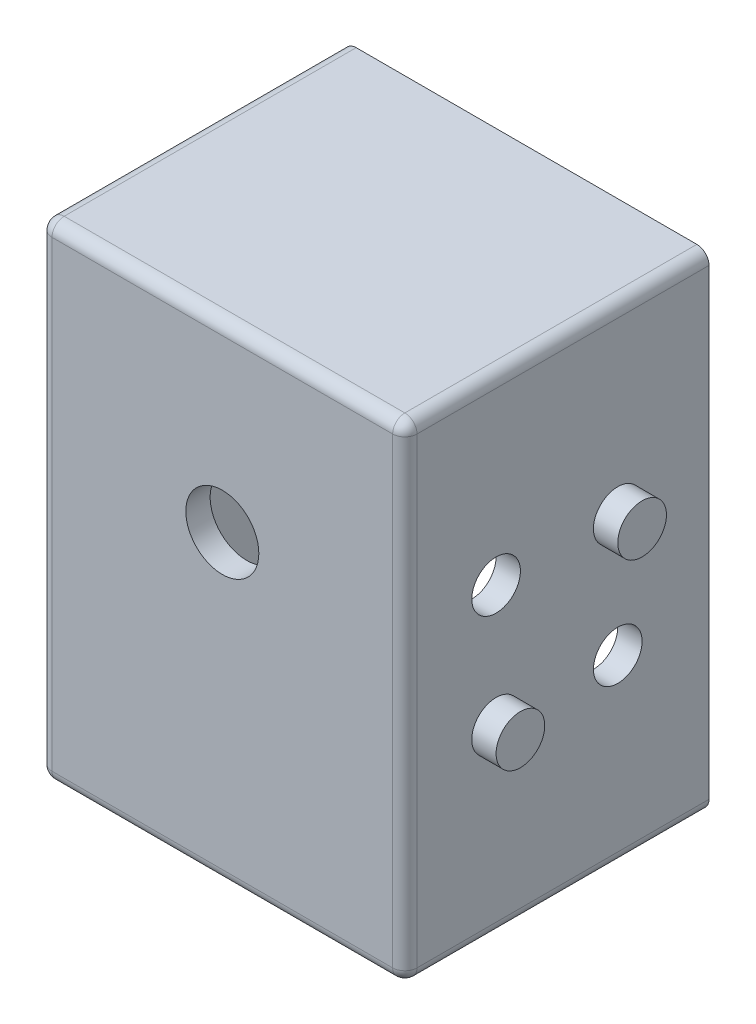
ISO-10303-21;
HEADER;
FILE_DESCRIPTION(('STEP AP214'),'2;1');
FILE_NAME('part.step','',(''),(''),'','','');
FILE_SCHEMA(('AUTOMOTIVE_DESIGN { 1 0 10303 214 1 1 1 1 }'));
ENDSEC;
DATA;
#1=APPLICATION_CONTEXT('core data for automotive mechanical design processes');
#2=APPLICATION_PROTOCOL_DEFINITION('international standard','automotive_design',2000,#1);
#3=PRODUCT_CONTEXT('',#1,'mechanical');
#4=PRODUCT('Part','Part','',(#3));
#5=PRODUCT_RELATED_PRODUCT_CATEGORY('part','',(#4));
#6=PRODUCT_DEFINITION_FORMATION('','',#4);
#7=PRODUCT_DEFINITION_CONTEXT('part definition',#1,'design');
#8=PRODUCT_DEFINITION('design','',#6,#7);
#9=PRODUCT_DEFINITION_SHAPE('','',#8);
#10=(LENGTH_UNIT() NAMED_UNIT(*) SI_UNIT(.MILLI.,.METRE.));
#11=(NAMED_UNIT(*) PLANE_ANGLE_UNIT() SI_UNIT($,.RADIAN.));
#12=(NAMED_UNIT(*) SI_UNIT($,.STERADIAN.) SOLID_ANGLE_UNIT());
#13=UNCERTAINTY_MEASURE_WITH_UNIT(LENGTH_MEASURE(1.E-05),#10,'distance_accuracy_value','');
#14=(GEOMETRIC_REPRESENTATION_CONTEXT(3) GLOBAL_UNCERTAINTY_ASSIGNED_CONTEXT((#13)) GLOBAL_UNIT_ASSIGNED_CONTEXT((#10,
#11,#12)) REPRESENTATION_CONTEXT('',''));
#15=CARTESIAN_POINT('',(0.,0.,0.));
#16=DIRECTION('',(0.,0.,1.));
#17=DIRECTION('',(1.,0.,0.));
#18=AXIS2_PLACEMENT_3D('',#15,#16,#17);
#19=CARTESIAN_POINT('',(0.,0.,0.));
#20=DIRECTION('',(0.,0.,-1.));
#21=DIRECTION('',(-1.,0.,0.));
#22=AXIS2_PLACEMENT_3D('',#19,#20,#21);
#23=PLANE('',#22);
#24=DIRECTION('',(0.,1.,0.));
#25=VECTOR('',#24,1.);
#26=CARTESIAN_POINT('',(30.,0.,0.));
#27=LINE('',#26,#25);
#28=CARTESIAN_POINT('',(30.,1.,0.));
#29=VERTEX_POINT('',#28);
#30=CARTESIAN_POINT('',(30.,39.,0.));
#31=VERTEX_POINT('',#30);
#32=EDGE_CURVE('E185',#29,#31,#27,.T.);
#33=ORIENTED_EDGE('',*,*,#32,.F.);
#34=CARTESIAN_POINT('',(29.,1.,0.));
#35=DIRECTION('',(0.,0.,-1.));
#36=DIRECTION('',(-1.,0.,0.));
#37=AXIS2_PLACEMENT_3D('',#34,#35,#36);
#38=CIRCLE('',#37,1.);
#39=CARTESIAN_POINT('',(29.,0.,0.));
#40=VERTEX_POINT('',#39);
#41=EDGE_CURVE('E245',#29,#40,#38,.T.);
#42=ORIENTED_EDGE('',*,*,#41,.T.);
#43=DIRECTION('',(1.,0.,0.));
#44=VECTOR('',#43,1.);
#45=CARTESIAN_POINT('',(0.,0.,0.));
#46=LINE('',#45,#44);
#47=CARTESIAN_POINT('',(1.,0.,0.));
#48=VERTEX_POINT('',#47);
#49=EDGE_CURVE('E188',#48,#40,#46,.T.);
#50=ORIENTED_EDGE('',*,*,#49,.F.);
#51=CARTESIAN_POINT('',(1.,1.,0.));
#52=DIRECTION('',(0.,0.,-1.));
#53=DIRECTION('',(-1.,0.,0.));
#54=AXIS2_PLACEMENT_3D('',#51,#52,#53);
#55=CIRCLE('',#54,1.);
#56=CARTESIAN_POINT('',(0.,1.,0.));
#57=VERTEX_POINT('',#56);
#58=EDGE_CURVE('E243',#48,#57,#55,.T.);
#59=ORIENTED_EDGE('',*,*,#58,.T.);
#60=DIRECTION('',(0.,1.,0.));
#61=VECTOR('',#60,1.);
#62=CARTESIAN_POINT('',(0.,0.,0.));
#63=LINE('',#62,#61);
#64=CARTESIAN_POINT('',(0.,39.,0.));
#65=VERTEX_POINT('',#64);
#66=EDGE_CURVE('E178',#57,#65,#63,.T.);
#67=ORIENTED_EDGE('',*,*,#66,.T.);
#68=CARTESIAN_POINT('',(0.999999999999993,39.,0.));
#69=DIRECTION('',(0.,0.,-1.));
#70=DIRECTION('',(-1.,0.,0.));
#71=AXIS2_PLACEMENT_3D('',#68,#69,#70);
#72=CIRCLE('',#71,1.);
#73=CARTESIAN_POINT('',(0.999999999999993,40.,0.));
#74=VERTEX_POINT('',#73);
#75=EDGE_CURVE('E241',#65,#74,#72,.T.);
#76=ORIENTED_EDGE('',*,*,#75,.T.);
#77=DIRECTION('',(1.,0.,0.));
#78=VECTOR('',#77,1.);
#79=CARTESIAN_POINT('',(0.,40.,0.));
#80=LINE('',#79,#78);
#81=CARTESIAN_POINT('',(29.,40.,0.));
#82=VERTEX_POINT('',#81);
#83=EDGE_CURVE('E181',#74,#82,#80,.T.);
#84=ORIENTED_EDGE('',*,*,#83,.T.);
#85=CARTESIAN_POINT('',(29.,39.,0.));
#86=DIRECTION('',(0.,0.,-1.));
#87=DIRECTION('',(-1.,0.,0.));
#88=AXIS2_PLACEMENT_3D('',#85,#86,#87);
#89=CIRCLE('',#88,1.);
#90=EDGE_CURVE('E239',#82,#31,#89,.T.);
#91=ORIENTED_EDGE('',*,*,#90,.T.);
#92=EDGE_LOOP('',(#33,#42,#50,#59,#67,#76,#84,#91));
#93=FACE_BOUND('',#92,.T.);
#94=DIRECTION('',(1.,0.,0.));
#95=VECTOR('',#94,1.);
#96=CARTESIAN_POINT('',(0.,2.,0.));
#97=LINE('',#96,#95);
#98=CARTESIAN_POINT('',(2.,2.,0.));
#99=VERTEX_POINT('',#98);
#100=CARTESIAN_POINT('',(28.,2.,0.));
#101=VERTEX_POINT('',#100);
#102=EDGE_CURVE('E172',#99,#101,#97,.T.);
#103=ORIENTED_EDGE('',*,*,#102,.T.);
#104=DIRECTION('',(0.,1.,0.));
#105=VECTOR('',#104,1.);
#106=CARTESIAN_POINT('',(28.,0.,0.));
#107=LINE('',#106,#105);
#108=CARTESIAN_POINT('',(28.,38.,0.));
#109=VERTEX_POINT('',#108);
#110=EDGE_CURVE('E153',#101,#109,#107,.T.);
#111=ORIENTED_EDGE('',*,*,#110,.T.);
#112=DIRECTION('',(1.,0.,0.));
#113=VECTOR('',#112,1.);
#114=CARTESIAN_POINT('',(0.,38.,0.));
#115=LINE('',#114,#113);
#116=CARTESIAN_POINT('',(1.99999999999999,38.,0.));
#117=VERTEX_POINT('',#116);
#118=EDGE_CURVE('E164',#117,#109,#115,.T.);
#119=ORIENTED_EDGE('',*,*,#118,.F.);
#120=DIRECTION('',(0.,1.,0.));
#121=VECTOR('',#120,1.);
#122=CARTESIAN_POINT('',(2.,0.,0.));
#123=LINE('',#122,#121);
#124=EDGE_CURVE('E169',#99,#117,#123,.T.);
#125=ORIENTED_EDGE('',*,*,#124,.F.);
#126=EDGE_LOOP('',(#103,#111,#119,#125));
#127=FACE_BOUND('',#126,.T.);
#128=ADVANCED_FACE('F35',(#93,#127),#23,.T.);
#129=CARTESIAN_POINT('',(0.,0.,25.));
#130=DIRECTION('',(-1.,0.,0.));
#131=DIRECTION('',(0.,-1.,0.));
#132=AXIS2_PLACEMENT_3D('',#129,#130,#131);
#133=PLANE('',#132);
#134=CARTESIAN_POINT('',(0.,15.,7.5));
#135=DIRECTION('',(-1.,0.,0.));
#136=DIRECTION('',(0.,-1.,0.));
#137=AXIS2_PLACEMENT_3D('',#134,#135,#136);
#138=CIRCLE('',#137,2.);
#139=CARTESIAN_POINT('',(0.,13.,7.5));
#140=VERTEX_POINT('',#139);
#141=EDGE_CURVE('E482',#140,#140,#138,.T.);
#142=ORIENTED_EDGE('',*,*,#141,.F.);
#143=EDGE_LOOP('',(#142));
#144=FACE_BOUND('',#143,.T.);
#145=CARTESIAN_POINT('',(0.,25.,16.5));
#146=DIRECTION('',(-1.,0.,0.));
#147=DIRECTION('',(0.,-1.,0.));
#148=AXIS2_PLACEMENT_3D('',#145,#146,#147);
#149=CIRCLE('',#148,2.);
#150=CARTESIAN_POINT('',(0.,23.,16.5));
#151=VERTEX_POINT('',#150);
#152=EDGE_CURVE('E481',#151,#151,#149,.T.);
#153=ORIENTED_EDGE('',*,*,#152,.F.);
#154=EDGE_LOOP('',(#153));
#155=FACE_BOUND('',#154,.T.);
#156=CARTESIAN_POINT('',(0.,25.,7.5));
#157=DIRECTION('',(-1.,0.,0.));
#158=DIRECTION('',(0.,-1.,0.));
#159=AXIS2_PLACEMENT_3D('',#156,#157,#158);
#160=CIRCLE('',#159,2.);
#161=CARTESIAN_POINT('',(0.,23.,7.5));
#162=VERTEX_POINT('',#161);
#163=EDGE_CURVE('E493',#162,#162,#160,.T.);
#164=ORIENTED_EDGE('',*,*,#163,.F.);
#165=EDGE_LOOP('',(#164));
#166=FACE_BOUND('',#165,.T.);
#167=CARTESIAN_POINT('',(0.,15.,16.5));
#168=DIRECTION('',(-1.,0.,0.));
#169=DIRECTION('',(0.,-1.,0.));
#170=AXIS2_PLACEMENT_3D('',#167,#168,#169);
#171=CIRCLE('',#170,2.);
#172=CARTESIAN_POINT('',(0.,13.,16.5));
#173=VERTEX_POINT('',#172);
#174=EDGE_CURVE('E496',#173,#173,#171,.T.);
#175=ORIENTED_EDGE('',*,*,#174,.F.);
#176=EDGE_LOOP('',(#175));
#177=FACE_BOUND('',#176,.T.);
#178=ORIENTED_EDGE('',*,*,#66,.F.);
#179=DIRECTION('',(0.,0.,-1.));
#180=VECTOR('',#179,1.);
#181=CARTESIAN_POINT('',(0.,1.,24.));
#182=LINE('',#181,#180);
#183=CARTESIAN_POINT('',(0.,1.,24.));
#184=VERTEX_POINT('',#183);
#185=EDGE_CURVE('E253',#57,#184,#182,.F.);
#186=ORIENTED_EDGE('',*,*,#185,.T.);
#187=DIRECTION('',(0.,1.,0.));
#188=VECTOR('',#187,1.);
#189=CARTESIAN_POINT('',(0.,40.,24.));
#190=LINE('',#189,#188);
#191=CARTESIAN_POINT('',(0.,39.,24.));
#192=VERTEX_POINT('',#191);
#193=EDGE_CURVE('E209',#184,#192,#190,.T.);
#194=ORIENTED_EDGE('',*,*,#193,.T.);
#195=DIRECTION('',(0.,0.,-1.));
#196=VECTOR('',#195,1.);
#197=CARTESIAN_POINT('',(0.,39.,25.));
#198=LINE('',#197,#196);
#199=EDGE_CURVE('E251',#192,#65,#198,.T.);
#200=ORIENTED_EDGE('',*,*,#199,.T.);
#201=EDGE_LOOP('',(#178,#186,#194,#200));
#202=FACE_BOUND('',#201,.T.);
#203=ADVANCED_FACE('F351',(#144,#155,#166,#177,#202),#133,.T.);
#204=CARTESIAN_POINT('',(0.,0.,25.));
#205=DIRECTION('',(0.,1.,0.));
#206=DIRECTION('',(0.,0.,1.));
#207=AXIS2_PLACEMENT_3D('',#204,#205,#206);
#208=PLANE('',#207);
#209=CARTESIAN_POINT('',(10.,0.,17.5));
#210=DIRECTION('',(0.,1.,0.));
#211=DIRECTION('',(0.,0.,1.));
#212=AXIS2_PLACEMENT_3D('',#209,#210,#211);
#213=CIRCLE('',#212,2.);
#214=CARTESIAN_POINT('',(10.,0.,19.5));
#215=VERTEX_POINT('',#214);
#216=EDGE_CURVE('E295',#215,#215,#213,.F.);
#217=ORIENTED_EDGE('',*,*,#216,.F.);
#218=EDGE_LOOP('',(#217));
#219=FACE_BOUND('',#218,.T.);
#220=CARTESIAN_POINT('',(20.,0.,7.5));
#221=DIRECTION('',(0.,1.,0.));
#222=DIRECTION('',(0.,0.,1.));
#223=AXIS2_PLACEMENT_3D('',#220,#221,#222);
#224=CIRCLE('',#223,2.);
#225=CARTESIAN_POINT('',(20.,0.,9.5));
#226=VERTEX_POINT('',#225);
#227=EDGE_CURVE('E281',#226,#226,#224,.F.);
#228=ORIENTED_EDGE('',*,*,#227,.F.);
#229=EDGE_LOOP('',(#228));
#230=FACE_BOUND('',#229,.T.);
#231=CARTESIAN_POINT('',(20.,0.,17.5));
#232=DIRECTION('',(0.,-1.,0.));
#233=DIRECTION('',(0.,0.,-1.));
#234=AXIS2_PLACEMENT_3D('',#231,#232,#233);
#235=CIRCLE('',#234,2.);
#236=CARTESIAN_POINT('',(20.,0.,15.5));
#237=VERTEX_POINT('',#236);
#238=EDGE_CURVE('E535',#237,#237,#235,.T.);
#239=ORIENTED_EDGE('',*,*,#238,.F.);
#240=EDGE_LOOP('',(#239));
#241=FACE_BOUND('',#240,.T.);
#242=CARTESIAN_POINT('',(10.,0.,7.5));
#243=DIRECTION('',(0.,-1.,0.));
#244=DIRECTION('',(0.,0.,-1.));
#245=AXIS2_PLACEMENT_3D('',#242,#243,#244);
#246=CIRCLE('',#245,2.);
#247=CARTESIAN_POINT('',(10.,0.,5.5));
#248=VERTEX_POINT('',#247);
#249=EDGE_CURVE('E538',#248,#248,#246,.T.);
#250=ORIENTED_EDGE('',*,*,#249,.F.);
#251=EDGE_LOOP('',(#250));
#252=FACE_BOUND('',#251,.T.);
#253=ORIENTED_EDGE('',*,*,#49,.T.);
#254=DIRECTION('',(0.,0.,-1.));
#255=VECTOR('',#254,1.);
#256=CARTESIAN_POINT('',(29.,0.,25.));
#257=LINE('',#256,#255);
#258=CARTESIAN_POINT('',(29.,0.,24.));
#259=VERTEX_POINT('',#258);
#260=EDGE_CURVE('E249',#40,#259,#257,.F.);
#261=ORIENTED_EDGE('',*,*,#260,.T.);
#262=DIRECTION('',(1.,0.,0.));
#263=VECTOR('',#262,1.);
#264=CARTESIAN_POINT('',(0.,0.,24.));
#265=LINE('',#264,#263);
#266=CARTESIAN_POINT('',(1.,0.,24.));
#267=VERTEX_POINT('',#266);
#268=EDGE_CURVE('E203',#259,#267,#265,.F.);
#269=ORIENTED_EDGE('',*,*,#268,.T.);
#270=DIRECTION('',(0.,0.,-1.));
#271=VECTOR('',#270,1.);
#272=CARTESIAN_POINT('',(1.,0.,0.));
#273=LINE('',#272,#271);
#274=EDGE_CURVE('E247',#267,#48,#273,.T.);
#275=ORIENTED_EDGE('',*,*,#274,.T.);
#276=EDGE_LOOP('',(#253,#261,#269,#275));
#277=FACE_BOUND('',#276,.T.);
#278=ADVANCED_FACE('F306',(#219,#230,#241,#252,#277),#208,.F.);
#279=CARTESIAN_POINT('',(30.,0.,25.));
#280=DIRECTION('',(-1.,0.,0.));
#281=DIRECTION('',(0.,-1.,0.));
#282=AXIS2_PLACEMENT_3D('',#279,#280,#281);
#283=PLANE('',#282);
#284=CARTESIAN_POINT('',(30.,15.,7.5));
#285=DIRECTION('',(1.,0.,0.));
#286=DIRECTION('',(0.,1.,0.));
#287=AXIS2_PLACEMENT_3D('',#284,#285,#286);
#288=CIRCLE('',#287,2.);
#289=CARTESIAN_POINT('',(30.,17.,7.5));
#290=VERTEX_POINT('',#289);
#291=EDGE_CURVE('E505',#290,#290,#288,.T.);
#292=ORIENTED_EDGE('',*,*,#291,.F.);
#293=EDGE_LOOP('',(#292));
#294=FACE_BOUND('',#293,.T.);
#295=CARTESIAN_POINT('',(30.,25.,17.5));
#296=DIRECTION('',(1.,0.,0.));
#297=DIRECTION('',(0.,1.,0.));
#298=AXIS2_PLACEMENT_3D('',#295,#296,#297);
#299=CIRCLE('',#298,2.);
#300=CARTESIAN_POINT('',(30.,27.,17.5));
#301=VERTEX_POINT('',#300);
#302=EDGE_CURVE('E508',#301,#301,#299,.T.);
#303=ORIENTED_EDGE('',*,*,#302,.F.);
#304=EDGE_LOOP('',(#303));
#305=FACE_BOUND('',#304,.T.);
#306=CARTESIAN_POINT('',(30.,25.,7.5));
#307=DIRECTION('',(-1.,0.,0.));
#308=DIRECTION('',(0.,-1.,0.));
#309=AXIS2_PLACEMENT_3D('',#306,#307,#308);
#310=CIRCLE('',#309,2.);
#311=CARTESIAN_POINT('',(30.,23.,7.5));
#312=VERTEX_POINT('',#311);
#313=EDGE_CURVE('E11',#312,#312,#310,.F.);
#314=ORIENTED_EDGE('',*,*,#313,.F.);
#315=EDGE_LOOP('',(#314));
#316=FACE_BOUND('',#315,.T.);
#317=CARTESIAN_POINT('',(30.,15.,17.5));
#318=DIRECTION('',(-1.,0.,0.));
#319=DIRECTION('',(0.,-1.,0.));
#320=AXIS2_PLACEMENT_3D('',#317,#318,#319);
#321=CIRCLE('',#320,2.);
#322=CARTESIAN_POINT('',(30.,13.,17.5));
#323=VERTEX_POINT('',#322);
#324=EDGE_CURVE('E43',#323,#323,#321,.F.);
#325=ORIENTED_EDGE('',*,*,#324,.F.);
#326=EDGE_LOOP('',(#325));
#327=FACE_BOUND('',#326,.T.);
#328=DIRECTION('',(0.,1.,0.));
#329=VECTOR('',#328,1.);
#330=CARTESIAN_POINT('',(30.,0.,24.));
#331=LINE('',#330,#329);
#332=CARTESIAN_POINT('',(30.,39.,24.));
#333=VERTEX_POINT('',#332);
#334=CARTESIAN_POINT('',(30.,1.,24.));
#335=VERTEX_POINT('',#334);
#336=EDGE_CURVE('E206',#333,#335,#331,.F.);
#337=ORIENTED_EDGE('',*,*,#336,.T.);
#338=DIRECTION('',(0.,0.,-1.));
#339=VECTOR('',#338,1.);
#340=CARTESIAN_POINT('',(30.,1.,25.));
#341=LINE('',#340,#339);
#342=EDGE_CURVE('E237',#335,#29,#341,.T.);
#343=ORIENTED_EDGE('',*,*,#342,.T.);
#344=ORIENTED_EDGE('',*,*,#32,.T.);
#345=DIRECTION('',(0.,0.,-1.));
#346=VECTOR('',#345,1.);
#347=CARTESIAN_POINT('',(30.,39.,24.));
#348=LINE('',#347,#346);
#349=EDGE_CURVE('E235',#31,#333,#348,.F.);
#350=ORIENTED_EDGE('',*,*,#349,.T.);
#351=EDGE_LOOP('',(#337,#343,#344,#350));
#352=FACE_BOUND('',#351,.T.);
#353=ADVANCED_FACE('F302',(#294,#305,#316,#327,#352),#283,.F.);
#354=CARTESIAN_POINT('',(0.,40.,25.));
#355=DIRECTION('',(0.,1.,0.));
#356=DIRECTION('',(0.,0.,1.));
#357=AXIS2_PLACEMENT_3D('',#354,#355,#356);
#358=PLANE('',#357);
#359=ORIENTED_EDGE('',*,*,#83,.F.);
#360=DIRECTION('',(0.,0.,-1.));
#361=VECTOR('',#360,1.);
#362=CARTESIAN_POINT('',(0.999999999999993,40.,25.));
#363=LINE('',#362,#361);
#364=CARTESIAN_POINT('',(0.999999999999994,40.,24.));
#365=VERTEX_POINT('',#364);
#366=EDGE_CURVE('E257',#74,#365,#363,.F.);
#367=ORIENTED_EDGE('',*,*,#366,.T.);
#368=DIRECTION('',(1.,0.,0.));
#369=VECTOR('',#368,1.);
#370=CARTESIAN_POINT('',(30.,40.,24.));
#371=LINE('',#370,#369);
#372=CARTESIAN_POINT('',(29.,40.,24.));
#373=VERTEX_POINT('',#372);
#374=EDGE_CURVE('E212',#365,#373,#371,.T.);
#375=ORIENTED_EDGE('',*,*,#374,.T.);
#376=DIRECTION('',(0.,0.,-1.));
#377=VECTOR('',#376,1.);
#378=CARTESIAN_POINT('',(29.,40.,0.));
#379=LINE('',#378,#377);
#380=EDGE_CURVE('E255',#373,#82,#379,.T.);
#381=ORIENTED_EDGE('',*,*,#380,.T.);
#382=EDGE_LOOP('',(#359,#367,#375,#381));
#383=FACE_BOUND('',#382,.T.);
#384=ADVANCED_FACE('F305',(#383),#358,.T.);
#385=CARTESIAN_POINT('',(0.,0.,25.));
#386=DIRECTION('',(0.,0.,-1.));
#387=DIRECTION('',(-1.,0.,0.));
#388=AXIS2_PLACEMENT_3D('',#385,#386,#387);
#389=PLANE('',#388);
#390=CARTESIAN_POINT('',(15.,25.,25.));
#391=DIRECTION('',(0.,0.,1.));
#392=DIRECTION('',(1.,0.,0.));
#393=AXIS2_PLACEMENT_3D('',#390,#391,#392);
#394=CIRCLE('',#393,3.);
#395=CARTESIAN_POINT('',(18.,25.,25.));
#396=VERTEX_POINT('',#395);
#397=EDGE_CURVE('E522',#396,#396,#394,.T.);
#398=ORIENTED_EDGE('',*,*,#397,.F.);
#399=EDGE_LOOP('',(#398));
#400=FACE_BOUND('',#399,.T.);
#401=DIRECTION('',(0.,1.,0.));
#402=VECTOR('',#401,1.);
#403=CARTESIAN_POINT('',(1.,0.,25.));
#404=LINE('',#403,#402);
#405=CARTESIAN_POINT('',(0.999999999999993,39.,25.));
#406=VERTEX_POINT('',#405);
#407=CARTESIAN_POINT('',(1.,1.,25.));
#408=VERTEX_POINT('',#407);
#409=EDGE_CURVE('E194',#406,#408,#404,.F.);
#410=ORIENTED_EDGE('',*,*,#409,.T.);
#411=DIRECTION('',(1.,0.,0.));
#412=VECTOR('',#411,1.);
#413=CARTESIAN_POINT('',(0.,1.,25.));
#414=LINE('',#413,#412);
#415=CARTESIAN_POINT('',(29.,1.,25.));
#416=VERTEX_POINT('',#415);
#417=EDGE_CURVE('E200',#408,#416,#414,.T.);
#418=ORIENTED_EDGE('',*,*,#417,.T.);
#419=DIRECTION('',(0.,1.,0.));
#420=VECTOR('',#419,1.);
#421=CARTESIAN_POINT('',(29.,0.,25.));
#422=LINE('',#421,#420);
#423=CARTESIAN_POINT('',(29.,39.,25.));
#424=VERTEX_POINT('',#423);
#425=EDGE_CURVE('E197',#416,#424,#422,.T.);
#426=ORIENTED_EDGE('',*,*,#425,.T.);
#427=DIRECTION('',(1.,0.,0.));
#428=VECTOR('',#427,1.);
#429=CARTESIAN_POINT('',(0.,39.,25.));
#430=LINE('',#429,#428);
#431=EDGE_CURVE('E191',#424,#406,#430,.F.);
#432=ORIENTED_EDGE('',*,*,#431,.T.);
#433=EDGE_LOOP('',(#410,#418,#426,#432));
#434=FACE_BOUND('',#433,.T.);
#435=ADVANCED_FACE('F333',(#400,#434),#389,.F.);
#436=CARTESIAN_POINT('',(0.,39.,24.));
#437=DIRECTION('',(-1.,0.,0.));
#438=DIRECTION('',(0.,0.,1.));
#439=AXIS2_PLACEMENT_3D('',#436,#437,#438);
#440=CYLINDRICAL_SURFACE('',#439,1.);
#441=ORIENTED_EDGE('',*,*,#374,.F.);
#442=CARTESIAN_POINT('',(0.999999999999993,39.,24.));
#443=DIRECTION('',(-1.,0.,0.));
#444=DIRECTION('',(0.,0.,1.));
#445=AXIS2_PLACEMENT_3D('',#442,#443,#444);
#446=CIRCLE('',#445,1.);
#447=EDGE_CURVE('E233',#365,#406,#446,.F.);
#448=ORIENTED_EDGE('',*,*,#447,.T.);
#449=ORIENTED_EDGE('',*,*,#431,.F.);
#450=CARTESIAN_POINT('',(29.,39.,24.));
#451=DIRECTION('',(-1.,0.,0.));
#452=DIRECTION('',(0.,0.,1.));
#453=AXIS2_PLACEMENT_3D('',#450,#451,#452);
#454=CIRCLE('',#453,1.);
#455=EDGE_CURVE('E231',#424,#373,#454,.T.);
#456=ORIENTED_EDGE('',*,*,#455,.T.);
#457=EDGE_LOOP('',(#441,#448,#449,#456));
#458=FACE_BOUND('',#457,.T.);
#459=ADVANCED_FACE('F381',(#458),#440,.T.);
#460=CARTESIAN_POINT('',(1.,0.,24.));
#461=DIRECTION('',(0.,-1.,0.));
#462=DIRECTION('',(1.,0.,0.));
#463=AXIS2_PLACEMENT_3D('',#460,#461,#462);
#464=CYLINDRICAL_SURFACE('',#463,1.);
#465=ORIENTED_EDGE('',*,*,#193,.F.);
#466=CARTESIAN_POINT('',(1.,1.,24.));
#467=DIRECTION('',(0.,-1.,0.));
#468=DIRECTION('',(1.,0.,0.));
#469=AXIS2_PLACEMENT_3D('',#466,#467,#468);
#470=CIRCLE('',#469,1.);
#471=EDGE_CURVE('E229',#184,#408,#470,.F.);
#472=ORIENTED_EDGE('',*,*,#471,.T.);
#473=ORIENTED_EDGE('',*,*,#409,.F.);
#474=CARTESIAN_POINT('',(0.999999999999993,39.,24.));
#475=DIRECTION('',(0.,-1.,0.));
#476=DIRECTION('',(1.,0.,0.));
#477=AXIS2_PLACEMENT_3D('',#474,#475,#476);
#478=CIRCLE('',#477,1.);
#479=EDGE_CURVE('E226',#406,#192,#478,.T.);
#480=ORIENTED_EDGE('',*,*,#479,.T.);
#481=EDGE_LOOP('',(#465,#472,#473,#480));
#482=FACE_BOUND('',#481,.T.);
#483=ADVANCED_FACE('F338',(#482),#464,.T.);
#484=CARTESIAN_POINT('',(29.,0.,24.));
#485=DIRECTION('',(0.,1.,0.));
#486=DIRECTION('',(-1.,0.,0.));
#487=AXIS2_PLACEMENT_3D('',#484,#485,#486);
#488=CYLINDRICAL_SURFACE('',#487,1.);
#489=ORIENTED_EDGE('',*,*,#425,.F.);
#490=CARTESIAN_POINT('',(29.,1.,24.));
#491=DIRECTION('',(0.,1.,0.));
#492=DIRECTION('',(-1.,0.,0.));
#493=AXIS2_PLACEMENT_3D('',#490,#491,#492);
#494=CIRCLE('',#493,1.);
#495=EDGE_CURVE('E224',#416,#335,#494,.T.);
#496=ORIENTED_EDGE('',*,*,#495,.T.);
#497=ORIENTED_EDGE('',*,*,#336,.F.);
#498=CARTESIAN_POINT('',(29.,39.,24.));
#499=DIRECTION('',(0.,1.,0.));
#500=DIRECTION('',(-1.,0.,0.));
#501=AXIS2_PLACEMENT_3D('',#498,#499,#500);
#502=CIRCLE('',#501,1.);
#503=EDGE_CURVE('E221',#333,#424,#502,.F.);
#504=ORIENTED_EDGE('',*,*,#503,.T.);
#505=EDGE_LOOP('',(#489,#496,#497,#504));
#506=FACE_BOUND('',#505,.T.);
#507=ADVANCED_FACE('F329',(#506),#488,.T.);
#508=CARTESIAN_POINT('',(0.,1.,24.));
#509=DIRECTION('',(1.,0.,0.));
#510=DIRECTION('',(0.,0.,-1.));
#511=AXIS2_PLACEMENT_3D('',#508,#509,#510);
#512=CYLINDRICAL_SURFACE('',#511,1.);
#513=ORIENTED_EDGE('',*,*,#268,.F.);
#514=CARTESIAN_POINT('',(29.,1.,24.));
#515=DIRECTION('',(1.,0.,0.));
#516=DIRECTION('',(0.,0.,-1.));
#517=AXIS2_PLACEMENT_3D('',#514,#515,#516);
#518=CIRCLE('',#517,1.);
#519=EDGE_CURVE('E218',#259,#416,#518,.F.);
#520=ORIENTED_EDGE('',*,*,#519,.T.);
#521=ORIENTED_EDGE('',*,*,#417,.F.);
#522=CARTESIAN_POINT('',(1.,1.,24.));
#523=DIRECTION('',(1.,0.,0.));
#524=DIRECTION('',(0.,0.,-1.));
#525=AXIS2_PLACEMENT_3D('',#522,#523,#524);
#526=CIRCLE('',#525,1.);
#527=EDGE_CURVE('E215',#408,#267,#526,.T.);
#528=ORIENTED_EDGE('',*,*,#527,.T.);
#529=EDGE_LOOP('',(#513,#520,#521,#528));
#530=FACE_BOUND('',#529,.T.);
#531=ADVANCED_FACE('F327',(#530),#512,.T.);
#532=CARTESIAN_POINT('',(29.,1.,25.));
#533=DIRECTION('',(0.,0.,-1.));
#534=DIRECTION('',(-1.,0.,0.));
#535=AXIS2_PLACEMENT_3D('',#532,#533,#534);
#536=CYLINDRICAL_SURFACE('',#535,1.);
#537=ORIENTED_EDGE('',*,*,#41,.F.);
#538=ORIENTED_EDGE('',*,*,#342,.F.);
#539=CARTESIAN_POINT('',(29.,1.,24.));
#540=DIRECTION('',(0.,0.,1.));
#541=DIRECTION('',(1.,0.,0.));
#542=AXIS2_PLACEMENT_3D('',#539,#540,#541);
#543=CIRCLE('',#542,1.);
#544=EDGE_CURVE('E182',#259,#335,#543,.T.);
#545=ORIENTED_EDGE('',*,*,#544,.F.);
#546=ORIENTED_EDGE('',*,*,#260,.F.);
#547=EDGE_LOOP('',(#537,#538,#545,#546));
#548=FACE_BOUND('',#547,.T.);
#549=ADVANCED_FACE('F318',(#548),#536,.T.);
#550=CARTESIAN_POINT('',(29.,1.,24.));
#551=DIRECTION('',(0.,0.,1.));
#552=DIRECTION('',(1.,0.,0.));
#553=AXIS2_PLACEMENT_3D('',#550,#551,#552);
#554=SPHERICAL_SURFACE('',#553,1.);
#555=ORIENTED_EDGE('',*,*,#544,.T.);
#556=ORIENTED_EDGE('',*,*,#495,.F.);
#557=ORIENTED_EDGE('',*,*,#519,.F.);
#558=EDGE_LOOP('',(#555,#556,#557));
#559=FACE_BOUND('',#558,.T.);
#560=ADVANCED_FACE('F322',(#559),#554,.T.);
#561=CARTESIAN_POINT('',(1.,1.,25.));
#562=DIRECTION('',(0.,0.,1.));
#563=DIRECTION('',(1.,0.,0.));
#564=AXIS2_PLACEMENT_3D('',#561,#562,#563);
#565=CYLINDRICAL_SURFACE('',#564,1.);
#566=ORIENTED_EDGE('',*,*,#58,.F.);
#567=ORIENTED_EDGE('',*,*,#274,.F.);
#568=CARTESIAN_POINT('',(1.,1.,24.));
#569=DIRECTION('',(0.,0.,1.));
#570=DIRECTION('',(1.,0.,0.));
#571=AXIS2_PLACEMENT_3D('',#568,#569,#570);
#572=CIRCLE('',#571,1.);
#573=EDGE_CURVE('E262',#184,#267,#572,.T.);
#574=ORIENTED_EDGE('',*,*,#573,.F.);
#575=ORIENTED_EDGE('',*,*,#185,.F.);
#576=EDGE_LOOP('',(#566,#567,#574,#575));
#577=FACE_BOUND('',#576,.T.);
#578=ADVANCED_FACE('F359',(#577),#565,.T.);
#579=CARTESIAN_POINT('',(1.,1.,24.));
#580=DIRECTION('',(0.,0.,1.));
#581=DIRECTION('',(1.,0.,0.));
#582=AXIS2_PLACEMENT_3D('',#579,#580,#581);
#583=SPHERICAL_SURFACE('',#582,1.);
#584=ORIENTED_EDGE('',*,*,#527,.F.);
#585=ORIENTED_EDGE('',*,*,#471,.F.);
#586=ORIENTED_EDGE('',*,*,#573,.T.);
#587=EDGE_LOOP('',(#584,#585,#586));
#588=FACE_BOUND('',#587,.T.);
#589=ADVANCED_FACE('F362',(#588),#583,.T.);
#590=CARTESIAN_POINT('',(0.999999999999993,39.,25.));
#591=DIRECTION('',(0.,0.,-1.));
#592=DIRECTION('',(-1.,0.,0.));
#593=AXIS2_PLACEMENT_3D('',#590,#591,#592);
#594=CYLINDRICAL_SURFACE('',#593,1.);
#595=ORIENTED_EDGE('',*,*,#75,.F.);
#596=ORIENTED_EDGE('',*,*,#199,.F.);
#597=CARTESIAN_POINT('',(0.999999999999993,39.,24.));
#598=DIRECTION('',(0.,0.,1.));
#599=DIRECTION('',(1.,0.,0.));
#600=AXIS2_PLACEMENT_3D('',#597,#598,#599);
#601=CIRCLE('',#600,1.);
#602=EDGE_CURVE('E264',#365,#192,#601,.T.);
#603=ORIENTED_EDGE('',*,*,#602,.F.);
#604=ORIENTED_EDGE('',*,*,#366,.F.);
#605=EDGE_LOOP('',(#595,#596,#603,#604));
#606=FACE_BOUND('',#605,.T.);
#607=ADVANCED_FACE('F348',(#606),#594,.T.);
#608=CARTESIAN_POINT('',(0.999999999999993,39.,24.));
#609=DIRECTION('',(0.,0.,1.));
#610=DIRECTION('',(1.,0.,0.));
#611=AXIS2_PLACEMENT_3D('',#608,#609,#610);
#612=SPHERICAL_SURFACE('',#611,1.);
#613=ORIENTED_EDGE('',*,*,#479,.F.);
#614=ORIENTED_EDGE('',*,*,#447,.F.);
#615=ORIENTED_EDGE('',*,*,#602,.T.);
#616=EDGE_LOOP('',(#613,#614,#615));
#617=FACE_BOUND('',#616,.T.);
#618=ADVANCED_FACE('F342',(#617),#612,.T.);
#619=CARTESIAN_POINT('',(29.,39.,25.));
#620=DIRECTION('',(0.,0.,1.));
#621=DIRECTION('',(1.,0.,0.));
#622=AXIS2_PLACEMENT_3D('',#619,#620,#621);
#623=CYLINDRICAL_SURFACE('',#622,1.);
#624=ORIENTED_EDGE('',*,*,#90,.F.);
#625=ORIENTED_EDGE('',*,*,#380,.F.);
#626=CARTESIAN_POINT('',(29.,39.,24.));
#627=DIRECTION('',(0.,0.,1.));
#628=DIRECTION('',(1.,0.,0.));
#629=AXIS2_PLACEMENT_3D('',#626,#627,#628);
#630=CIRCLE('',#629,1.);
#631=EDGE_CURVE('E160',#333,#373,#630,.T.);
#632=ORIENTED_EDGE('',*,*,#631,.F.);
#633=ORIENTED_EDGE('',*,*,#349,.F.);
#634=EDGE_LOOP('',(#624,#625,#632,#633));
#635=FACE_BOUND('',#634,.T.);
#636=ADVANCED_FACE('F571',(#635),#623,.T.);
#637=CARTESIAN_POINT('',(29.,39.,24.));
#638=DIRECTION('',(0.,0.,1.));
#639=DIRECTION('',(1.,0.,0.));
#640=AXIS2_PLACEMENT_3D('',#637,#638,#639);
#641=SPHERICAL_SURFACE('',#640,1.);
#642=ORIENTED_EDGE('',*,*,#631,.T.);
#643=ORIENTED_EDGE('',*,*,#455,.F.);
#644=ORIENTED_EDGE('',*,*,#503,.F.);
#645=EDGE_LOOP('',(#642,#643,#644));
#646=FACE_BOUND('',#645,.T.);
#647=ADVANCED_FACE('F399',(#646),#641,.T.);
#648=CARTESIAN_POINT('',(2.,0.,25.));
#649=DIRECTION('',(-1.,0.,0.));
#650=DIRECTION('',(0.,-1.,0.));
#651=AXIS2_PLACEMENT_3D('',#648,#649,#650);
#652=PLANE('',#651);
#653=CARTESIAN_POINT('',(2.,25.,7.5));
#654=DIRECTION('',(-1.,0.,0.));
#655=DIRECTION('',(0.,-1.,0.));
#656=AXIS2_PLACEMENT_3D('',#653,#654,#655);
#657=CIRCLE('',#656,2.);
#658=CARTESIAN_POINT('',(2.,23.,7.5));
#659=VERTEX_POINT('',#658);
#660=EDGE_CURVE('E491',#659,#659,#657,.T.);
#661=ORIENTED_EDGE('',*,*,#660,.T.);
#662=EDGE_LOOP('',(#661));
#663=FACE_BOUND('',#662,.T.);
#664=CARTESIAN_POINT('',(2.,15.,16.5));
#665=DIRECTION('',(-1.,0.,0.));
#666=DIRECTION('',(0.,-1.,0.));
#667=AXIS2_PLACEMENT_3D('',#664,#665,#666);
#668=CIRCLE('',#667,2.);
#669=CARTESIAN_POINT('',(2.,13.,16.5));
#670=VERTEX_POINT('',#669);
#671=EDGE_CURVE('E499',#670,#670,#668,.T.);
#672=ORIENTED_EDGE('',*,*,#671,.T.);
#673=EDGE_LOOP('',(#672));
#674=FACE_BOUND('',#673,.T.);
#675=DIRECTION('',(0.,0.,-1.));
#676=VECTOR('',#675,1.);
#677=CARTESIAN_POINT('',(1.99999999999999,38.,25.));
#678=LINE('',#677,#676);
#679=CARTESIAN_POINT('',(1.99999999999999,38.,22.));
#680=VERTEX_POINT('',#679);
#681=EDGE_CURVE('E161',#680,#117,#678,.T.);
#682=ORIENTED_EDGE('',*,*,#681,.F.);
#683=DIRECTION('',(0.,-1.,0.));
#684=VECTOR('',#683,1.);
#685=CARTESIAN_POINT('',(2.,0.,22.));
#686=LINE('',#685,#684);
#687=CARTESIAN_POINT('',(2.,2.,22.));
#688=VERTEX_POINT('',#687);
#689=EDGE_CURVE('E58',#680,#688,#686,.T.);
#690=ORIENTED_EDGE('',*,*,#689,.T.);
#691=DIRECTION('',(0.,0.,-1.));
#692=VECTOR('',#691,1.);
#693=CARTESIAN_POINT('',(2.,2.,25.));
#694=LINE('',#693,#692);
#695=EDGE_CURVE('E545',#688,#99,#694,.T.);
#696=ORIENTED_EDGE('',*,*,#695,.T.);
#697=ORIENTED_EDGE('',*,*,#124,.T.);
#698=EDGE_LOOP('',(#682,#690,#696,#697));
#699=FACE_BOUND('',#698,.T.);
#700=ADVANCED_FACE('F395',(#663,#674,#699),#652,.F.);
#701=CARTESIAN_POINT('',(0.,2.,25.));
#702=DIRECTION('',(0.,1.,0.));
#703=DIRECTION('',(0.,0.,1.));
#704=AXIS2_PLACEMENT_3D('',#701,#702,#703);
#705=PLANE('',#704);
#706=CARTESIAN_POINT('',(20.,2.,17.5));
#707=DIRECTION('',(0.,-1.,0.));
#708=DIRECTION('',(0.,0.,-1.));
#709=AXIS2_PLACEMENT_3D('',#706,#707,#708);
#710=CIRCLE('',#709,2.);
#711=CARTESIAN_POINT('',(20.,2.,15.5));
#712=VERTEX_POINT('',#711);
#713=EDGE_CURVE('E534',#712,#712,#710,.T.);
#714=ORIENTED_EDGE('',*,*,#713,.T.);
#715=EDGE_LOOP('',(#714));
#716=FACE_BOUND('',#715,.T.);
#717=CARTESIAN_POINT('',(10.,2.,7.5));
#718=DIRECTION('',(0.,-1.,0.));
#719=DIRECTION('',(0.,0.,-1.));
#720=AXIS2_PLACEMENT_3D('',#717,#718,#719);
#721=CIRCLE('',#720,2.);
#722=CARTESIAN_POINT('',(10.,2.,5.5));
#723=VERTEX_POINT('',#722);
#724=EDGE_CURVE('E285',#723,#723,#721,.T.);
#725=ORIENTED_EDGE('',*,*,#724,.T.);
#726=EDGE_LOOP('',(#725));
#727=FACE_BOUND('',#726,.T.);
#728=ORIENTED_EDGE('',*,*,#695,.F.);
#729=DIRECTION('',(1.,0.,0.));
#730=VECTOR('',#729,1.);
#731=CARTESIAN_POINT('',(28.,2.,22.));
#732=LINE('',#731,#730);
#733=CARTESIAN_POINT('',(28.,2.,22.));
#734=VERTEX_POINT('',#733);
#735=EDGE_CURVE('E50',#688,#734,#732,.T.);
#736=ORIENTED_EDGE('',*,*,#735,.T.);
#737=DIRECTION('',(0.,0.,-1.));
#738=VECTOR('',#737,1.);
#739=CARTESIAN_POINT('',(28.,2.,25.));
#740=LINE('',#739,#738);
#741=EDGE_CURVE('E174',#734,#101,#740,.T.);
#742=ORIENTED_EDGE('',*,*,#741,.T.);
#743=ORIENTED_EDGE('',*,*,#102,.F.);
#744=EDGE_LOOP('',(#728,#736,#742,#743));
#745=FACE_BOUND('',#744,.T.);
#746=ADVANCED_FACE('F391',(#716,#727,#745),#705,.T.);
#747=CARTESIAN_POINT('',(28.,0.,25.));
#748=DIRECTION('',(-1.,0.,0.));
#749=DIRECTION('',(0.,-1.,0.));
#750=AXIS2_PLACEMENT_3D('',#747,#748,#749);
#751=PLANE('',#750);
#752=CARTESIAN_POINT('',(28.,15.,7.5));
#753=DIRECTION('',(1.,0.,0.));
#754=DIRECTION('',(0.,1.,0.));
#755=AXIS2_PLACEMENT_3D('',#752,#753,#754);
#756=CIRCLE('',#755,2.);
#757=CARTESIAN_POINT('',(28.,17.,7.5));
#758=VERTEX_POINT('',#757);
#759=EDGE_CURVE('E502',#758,#758,#756,.T.);
#760=ORIENTED_EDGE('',*,*,#759,.T.);
#761=EDGE_LOOP('',(#760));
#762=FACE_BOUND('',#761,.T.);
#763=CARTESIAN_POINT('',(28.,25.,17.5));
#764=DIRECTION('',(1.,0.,0.));
#765=DIRECTION('',(0.,1.,0.));
#766=AXIS2_PLACEMENT_3D('',#763,#764,#765);
#767=CIRCLE('',#766,2.);
#768=CARTESIAN_POINT('',(28.,27.,17.5));
#769=VERTEX_POINT('',#768);
#770=EDGE_CURVE('E511',#769,#769,#767,.T.);
#771=ORIENTED_EDGE('',*,*,#770,.T.);
#772=EDGE_LOOP('',(#771));
#773=FACE_BOUND('',#772,.T.);
#774=ORIENTED_EDGE('',*,*,#741,.F.);
#775=DIRECTION('',(0.,-1.,0.));
#776=VECTOR('',#775,1.);
#777=CARTESIAN_POINT('',(28.,38.,22.));
#778=LINE('',#777,#776);
#779=CARTESIAN_POINT('',(28.,38.,22.));
#780=VERTEX_POINT('',#779);
#781=EDGE_CURVE('E156',#734,#780,#778,.F.);
#782=ORIENTED_EDGE('',*,*,#781,.T.);
#783=DIRECTION('',(0.,0.,-1.));
#784=VECTOR('',#783,1.);
#785=CARTESIAN_POINT('',(28.,38.,25.));
#786=LINE('',#785,#784);
#787=EDGE_CURVE('E149',#780,#109,#786,.T.);
#788=ORIENTED_EDGE('',*,*,#787,.T.);
#789=ORIENTED_EDGE('',*,*,#110,.F.);
#790=EDGE_LOOP('',(#774,#782,#788,#789));
#791=FACE_BOUND('',#790,.T.);
#792=ADVANCED_FACE('F151',(#762,#773,#791),#751,.T.);
#793=CARTESIAN_POINT('',(0.,38.,25.));
#794=DIRECTION('',(0.,1.,0.));
#795=DIRECTION('',(0.,0.,1.));
#796=AXIS2_PLACEMENT_3D('',#793,#794,#795);
#797=PLANE('',#796);
#798=ORIENTED_EDGE('',*,*,#787,.F.);
#799=DIRECTION('',(-1.,0.,0.));
#800=VECTOR('',#799,1.);
#801=CARTESIAN_POINT('',(0.,38.,22.));
#802=LINE('',#801,#800);
#803=EDGE_CURVE('E259',#780,#680,#802,.T.);
#804=ORIENTED_EDGE('',*,*,#803,.T.);
#805=ORIENTED_EDGE('',*,*,#681,.T.);
#806=ORIENTED_EDGE('',*,*,#118,.T.);
#807=EDGE_LOOP('',(#798,#804,#805,#806));
#808=FACE_BOUND('',#807,.T.);
#809=ADVANCED_FACE('F165',(#808),#797,.F.);
#810=CARTESIAN_POINT('',(0.,0.,23.));
#811=DIRECTION('',(0.,0.,-1.));
#812=DIRECTION('',(-1.,0.,0.));
#813=AXIS2_PLACEMENT_3D('',#810,#811,#812);
#814=PLANE('',#813);
#815=CARTESIAN_POINT('',(15.,25.,23.));
#816=DIRECTION('',(0.,0.,1.));
#817=DIRECTION('',(1.,0.,0.));
#818=AXIS2_PLACEMENT_3D('',#815,#816,#817);
#819=CIRCLE('',#818,3.);
#820=CARTESIAN_POINT('',(18.,25.,23.));
#821=VERTEX_POINT('',#820);
#822=EDGE_CURVE('E523',#821,#821,#819,.T.);
#823=ORIENTED_EDGE('',*,*,#822,.T.);
#824=EDGE_LOOP('',(#823));
#825=FACE_BOUND('',#824,.T.);
#826=DIRECTION('',(-1.,0.,0.));
#827=VECTOR('',#826,1.);
#828=CARTESIAN_POINT('',(0.,37.,23.));
#829=LINE('',#828,#827);
#830=CARTESIAN_POINT('',(2.99999999999999,37.,23.));
#831=VERTEX_POINT('',#830);
#832=CARTESIAN_POINT('',(27.,37.,23.));
#833=VERTEX_POINT('',#832);
#834=EDGE_CURVE('E273',#831,#833,#829,.F.);
#835=ORIENTED_EDGE('',*,*,#834,.T.);
#836=DIRECTION('',(0.,-1.,0.));
#837=VECTOR('',#836,1.);
#838=CARTESIAN_POINT('',(27.,2.,23.));
#839=LINE('',#838,#837);
#840=CARTESIAN_POINT('',(27.,3.,23.));
#841=VERTEX_POINT('',#840);
#842=EDGE_CURVE('E276',#833,#841,#839,.T.);
#843=ORIENTED_EDGE('',*,*,#842,.T.);
#844=DIRECTION('',(1.,0.,0.));
#845=VECTOR('',#844,1.);
#846=CARTESIAN_POINT('',(2.,3.,23.));
#847=LINE('',#846,#845);
#848=CARTESIAN_POINT('',(3.,3.,23.));
#849=VERTEX_POINT('',#848);
#850=EDGE_CURVE('E271',#841,#849,#847,.F.);
#851=ORIENTED_EDGE('',*,*,#850,.T.);
#852=DIRECTION('',(0.,-1.,0.));
#853=VECTOR('',#852,1.);
#854=CARTESIAN_POINT('',(3.,0.,23.));
#855=LINE('',#854,#853);
#856=EDGE_CURVE('E269',#849,#831,#855,.F.);
#857=ORIENTED_EDGE('',*,*,#856,.T.);
#858=EDGE_LOOP('',(#835,#843,#851,#857));
#859=FACE_BOUND('',#858,.T.);
#860=ADVANCED_FACE('F383',(#825,#859),#814,.T.);
#861=CARTESIAN_POINT('',(0.,3.,22.));
#862=DIRECTION('',(-1.,0.,0.));
#863=DIRECTION('',(0.,0.,1.));
#864=AXIS2_PLACEMENT_3D('',#861,#862,#863);
#865=CYLINDRICAL_SURFACE('',#864,1.);
#866=CARTESIAN_POINT('',(3.,3.,22.));
#867=DIRECTION('',(-0.707106781186548,0.707106781186547,0.));
#868=DIRECTION('',(-0.707106781186547,-0.707106781186548,0.));
#869=AXIS2_PLACEMENT_3D('',#866,#867,#868);
#870=ELLIPSE('',#869,1.41421356237309,1.);
#871=EDGE_CURVE('E287',#849,#688,#870,.F.);
#872=ORIENTED_EDGE('',*,*,#871,.F.);
#873=ORIENTED_EDGE('',*,*,#850,.F.);
#874=CARTESIAN_POINT('',(27.,3.,22.));
#875=DIRECTION('',(-0.707106781186547,-0.707106781186548,0.));
#876=DIRECTION('',(-0.707106781186548,0.707106781186547,0.));
#877=AXIS2_PLACEMENT_3D('',#874,#875,#876);
#878=ELLIPSE('',#877,1.4142135623731,1.);
#879=EDGE_CURVE('E290',#734,#841,#878,.T.);
#880=ORIENTED_EDGE('',*,*,#879,.F.);
#881=ORIENTED_EDGE('',*,*,#735,.F.);
#882=EDGE_LOOP('',(#872,#873,#880,#881));
#883=FACE_BOUND('',#882,.T.);
#884=ADVANCED_FACE('F37',(#883),#865,.F.);
#885=CARTESIAN_POINT('',(27.,0.,22.));
#886=DIRECTION('',(0.,1.,0.));
#887=DIRECTION('',(-1.,0.,0.));
#888=AXIS2_PLACEMENT_3D('',#885,#886,#887);
#889=CYLINDRICAL_SURFACE('',#888,1.);
#890=ORIENTED_EDGE('',*,*,#879,.T.);
#891=ORIENTED_EDGE('',*,*,#842,.F.);
#892=CARTESIAN_POINT('',(27.,37.,22.));
#893=DIRECTION('',(-0.707106781186548,0.707106781186547,0.));
#894=DIRECTION('',(-0.707106781186547,-0.707106781186548,0.));
#895=AXIS2_PLACEMENT_3D('',#892,#893,#894);
#896=ELLIPSE('',#895,1.41421356237309,1.);
#897=EDGE_CURVE('E284',#780,#833,#896,.F.);
#898=ORIENTED_EDGE('',*,*,#897,.F.);
#899=ORIENTED_EDGE('',*,*,#781,.F.);
#900=EDGE_LOOP('',(#890,#891,#898,#899));
#901=FACE_BOUND('',#900,.T.);
#902=ADVANCED_FACE('F554',(#901),#889,.F.);
#903=CARTESIAN_POINT('',(3.,0.,22.));
#904=DIRECTION('',(0.,-1.,0.));
#905=DIRECTION('',(1.,0.,0.));
#906=AXIS2_PLACEMENT_3D('',#903,#904,#905);
#907=CYLINDRICAL_SURFACE('',#906,1.);
#908=ORIENTED_EDGE('',*,*,#871,.T.);
#909=ORIENTED_EDGE('',*,*,#689,.F.);
#910=CARTESIAN_POINT('',(2.99999999999999,37.,22.));
#911=DIRECTION('',(-0.707106781186547,-0.707106781186548,0.));
#912=DIRECTION('',(-0.707106781186548,0.707106781186547,0.));
#913=AXIS2_PLACEMENT_3D('',#910,#911,#912);
#914=ELLIPSE('',#913,1.4142135623731,1.);
#915=EDGE_CURVE('E282',#831,#680,#914,.T.);
#916=ORIENTED_EDGE('',*,*,#915,.F.);
#917=ORIENTED_EDGE('',*,*,#856,.F.);
#918=EDGE_LOOP('',(#908,#909,#916,#917));
#919=FACE_BOUND('',#918,.T.);
#920=ADVANCED_FACE('F561',(#919),#907,.F.);
#921=CARTESIAN_POINT('',(0.,37.,22.));
#922=DIRECTION('',(-1.,0.,0.));
#923=DIRECTION('',(0.,0.,1.));
#924=AXIS2_PLACEMENT_3D('',#921,#922,#923);
#925=CYLINDRICAL_SURFACE('',#924,1.);
#926=ORIENTED_EDGE('',*,*,#897,.T.);
#927=ORIENTED_EDGE('',*,*,#834,.F.);
#928=ORIENTED_EDGE('',*,*,#915,.T.);
#929=ORIENTED_EDGE('',*,*,#803,.F.);
#930=EDGE_LOOP('',(#926,#927,#928,#929));
#931=FACE_BOUND('',#930,.T.);
#932=ADVANCED_FACE('F405',(#931),#925,.F.);
#933=CARTESIAN_POINT('',(10.,2.,7.5));
#934=DIRECTION('',(0.,-1.,0.));
#935=DIRECTION('',(0.,0.,-1.));
#936=AXIS2_PLACEMENT_3D('',#933,#934,#935);
#937=CYLINDRICAL_SURFACE('',#936,2.);
#938=ORIENTED_EDGE('',*,*,#724,.F.);
#939=EDGE_LOOP('',(#938));
#940=FACE_BOUND('',#939,.T.);
#941=ORIENTED_EDGE('',*,*,#249,.T.);
#942=EDGE_LOOP('',(#941));
#943=FACE_BOUND('',#942,.T.);
#944=ADVANCED_FACE('F401',(#940,#943),#937,.F.);
#945=CARTESIAN_POINT('',(20.,2.,17.5));
#946=DIRECTION('',(0.,-1.,0.));
#947=DIRECTION('',(0.,0.,-1.));
#948=AXIS2_PLACEMENT_3D('',#945,#946,#947);
#949=CYLINDRICAL_SURFACE('',#948,2.);
#950=ORIENTED_EDGE('',*,*,#713,.F.);
#951=EDGE_LOOP('',(#950));
#952=FACE_BOUND('',#951,.T.);
#953=ORIENTED_EDGE('',*,*,#238,.T.);
#954=EDGE_LOOP('',(#953));
#955=FACE_BOUND('',#954,.T.);
#956=ADVANCED_FACE('F404',(#952,#955),#949,.F.);
#957=CARTESIAN_POINT('',(20.,-2.,7.5));
#958=DIRECTION('',(0.,1.,0.));
#959=DIRECTION('',(0.,0.,1.));
#960=AXIS2_PLACEMENT_3D('',#957,#958,#959);
#961=CYLINDRICAL_SURFACE('',#960,2.);
#962=CARTESIAN_POINT('',(20.,-2.,7.5));
#963=DIRECTION('',(0.,-1.,0.));
#964=DIRECTION('',(0.,0.,-1.));
#965=AXIS2_PLACEMENT_3D('',#962,#963,#964);
#966=CIRCLE('',#965,2.);
#967=CARTESIAN_POINT('',(20.,-2.,5.5));
#968=VERTEX_POINT('',#967);
#969=EDGE_CURVE('E531',#968,#968,#966,.T.);
#970=ORIENTED_EDGE('',*,*,#969,.F.);
#971=EDGE_LOOP('',(#970));
#972=FACE_BOUND('',#971,.T.);
#973=ORIENTED_EDGE('',*,*,#227,.T.);
#974=EDGE_LOOP('',(#973));
#975=FACE_BOUND('',#974,.T.);
#976=ADVANCED_FACE('F409',(#972,#975),#961,.T.);
#977=CARTESIAN_POINT('',(20.,-2.,7.5));
#978=DIRECTION('',(0.,-1.,0.));
#979=DIRECTION('',(0.,0.,-1.));
#980=AXIS2_PLACEMENT_3D('',#977,#978,#979);
#981=PLANE('',#980);
#982=ORIENTED_EDGE('',*,*,#969,.T.);
#983=EDGE_LOOP('',(#982));
#984=FACE_BOUND('',#983,.T.);
#985=ADVANCED_FACE('F413',(#984),#981,.T.);
#986=CARTESIAN_POINT('',(10.,-2.,17.5));
#987=DIRECTION('',(0.,1.,0.));
#988=DIRECTION('',(0.,0.,1.));
#989=AXIS2_PLACEMENT_3D('',#986,#987,#988);
#990=CYLINDRICAL_SURFACE('',#989,2.);
#991=CARTESIAN_POINT('',(10.,-2.,17.5));
#992=DIRECTION('',(0.,-1.,0.));
#993=DIRECTION('',(0.,0.,-1.));
#994=AXIS2_PLACEMENT_3D('',#991,#992,#993);
#995=CIRCLE('',#994,2.);
#996=CARTESIAN_POINT('',(10.,-2.,15.5));
#997=VERTEX_POINT('',#996);
#998=EDGE_CURVE('E526',#997,#997,#995,.T.);
#999=ORIENTED_EDGE('',*,*,#998,.F.);
#1000=EDGE_LOOP('',(#999));
#1001=FACE_BOUND('',#1000,.T.);
#1002=ORIENTED_EDGE('',*,*,#216,.T.);
#1003=EDGE_LOOP('',(#1002));
#1004=FACE_BOUND('',#1003,.T.);
#1005=ADVANCED_FACE('F417',(#1001,#1004),#990,.T.);
#1006=CARTESIAN_POINT('',(10.,-2.,17.5));
#1007=DIRECTION('',(0.,-1.,0.));
#1008=DIRECTION('',(0.,0.,-1.));
#1009=AXIS2_PLACEMENT_3D('',#1006,#1007,#1008);
#1010=PLANE('',#1009);
#1011=ORIENTED_EDGE('',*,*,#998,.T.);
#1012=EDGE_LOOP('',(#1011));
#1013=FACE_BOUND('',#1012,.T.);
#1014=ADVANCED_FACE('F419',(#1013),#1010,.T.);
#1015=CARTESIAN_POINT('',(15.,25.,23.));
#1016=DIRECTION('',(0.,0.,1.));
#1017=DIRECTION('',(1.,0.,0.));
#1018=AXIS2_PLACEMENT_3D('',#1015,#1016,#1017);
#1019=CYLINDRICAL_SURFACE('',#1018,3.);
#1020=ORIENTED_EDGE('',*,*,#822,.F.);
#1021=EDGE_LOOP('',(#1020));
#1022=FACE_BOUND('',#1021,.T.);
#1023=ORIENTED_EDGE('',*,*,#397,.T.);
#1024=EDGE_LOOP('',(#1023));
#1025=FACE_BOUND('',#1024,.T.);
#1026=ADVANCED_FACE('F422',(#1022,#1025),#1019,.F.);
#1027=CARTESIAN_POINT('',(32.,15.,17.5));
#1028=DIRECTION('',(-1.,0.,0.));
#1029=DIRECTION('',(0.,-1.,0.));
#1030=AXIS2_PLACEMENT_3D('',#1027,#1028,#1029);
#1031=CYLINDRICAL_SURFACE('',#1030,2.);
#1032=CARTESIAN_POINT('',(32.,15.,17.5));
#1033=DIRECTION('',(1.,0.,0.));
#1034=DIRECTION('',(0.,1.,0.));
#1035=AXIS2_PLACEMENT_3D('',#1032,#1033,#1034);
#1036=CIRCLE('',#1035,2.);
#1037=CARTESIAN_POINT('',(32.,17.,17.5));
#1038=VERTEX_POINT('',#1037);
#1039=EDGE_CURVE('E519',#1038,#1038,#1036,.T.);
#1040=ORIENTED_EDGE('',*,*,#1039,.F.);
#1041=EDGE_LOOP('',(#1040));
#1042=FACE_BOUND('',#1041,.T.);
#1043=ORIENTED_EDGE('',*,*,#324,.T.);
#1044=EDGE_LOOP('',(#1043));
#1045=FACE_BOUND('',#1044,.T.);
#1046=ADVANCED_FACE('F300',(#1042,#1045),#1031,.T.);
#1047=CARTESIAN_POINT('',(32.,15.,17.5));
#1048=DIRECTION('',(1.,0.,0.));
#1049=DIRECTION('',(0.,1.,0.));
#1050=AXIS2_PLACEMENT_3D('',#1047,#1048,#1049);
#1051=PLANE('',#1050);
#1052=ORIENTED_EDGE('',*,*,#1039,.T.);
#1053=EDGE_LOOP('',(#1052));
#1054=FACE_BOUND('',#1053,.T.);
#1055=ADVANCED_FACE('F432',(#1054),#1051,.T.);
#1056=CARTESIAN_POINT('',(32.,25.,7.5));
#1057=DIRECTION('',(-1.,0.,0.));
#1058=DIRECTION('',(0.,-1.,0.));
#1059=AXIS2_PLACEMENT_3D('',#1056,#1057,#1058);
#1060=CYLINDRICAL_SURFACE('',#1059,2.);
#1061=CARTESIAN_POINT('',(32.,25.,7.5));
#1062=DIRECTION('',(1.,0.,0.));
#1063=DIRECTION('',(0.,1.,0.));
#1064=AXIS2_PLACEMENT_3D('',#1061,#1062,#1063);
#1065=CIRCLE('',#1064,2.);
#1066=CARTESIAN_POINT('',(32.,27.,7.5));
#1067=VERTEX_POINT('',#1066);
#1068=EDGE_CURVE('E514',#1067,#1067,#1065,.T.);
#1069=ORIENTED_EDGE('',*,*,#1068,.F.);
#1070=EDGE_LOOP('',(#1069));
#1071=FACE_BOUND('',#1070,.T.);
#1072=ORIENTED_EDGE('',*,*,#313,.T.);
#1073=EDGE_LOOP('',(#1072));
#1074=FACE_BOUND('',#1073,.T.);
#1075=ADVANCED_FACE('F436',(#1071,#1074),#1060,.T.);
#1076=CARTESIAN_POINT('',(32.,25.,7.5));
#1077=DIRECTION('',(1.,0.,0.));
#1078=DIRECTION('',(0.,1.,0.));
#1079=AXIS2_PLACEMENT_3D('',#1076,#1077,#1078);
#1080=PLANE('',#1079);
#1081=ORIENTED_EDGE('',*,*,#1068,.T.);
#1082=EDGE_LOOP('',(#1081));
#1083=FACE_BOUND('',#1082,.T.);
#1084=ADVANCED_FACE('F438',(#1083),#1080,.T.);
#1085=CARTESIAN_POINT('',(28.,25.,17.5));
#1086=DIRECTION('',(1.,0.,0.));
#1087=DIRECTION('',(0.,1.,0.));
#1088=AXIS2_PLACEMENT_3D('',#1085,#1086,#1087);
#1089=CYLINDRICAL_SURFACE('',#1088,2.);
#1090=ORIENTED_EDGE('',*,*,#770,.F.);
#1091=EDGE_LOOP('',(#1090));
#1092=FACE_BOUND('',#1091,.T.);
#1093=ORIENTED_EDGE('',*,*,#302,.T.);
#1094=EDGE_LOOP('',(#1093));
#1095=FACE_BOUND('',#1094,.T.);
#1096=ADVANCED_FACE('F441',(#1092,#1095),#1089,.F.);
#1097=CARTESIAN_POINT('',(28.,15.,7.5));
#1098=DIRECTION('',(1.,0.,0.));
#1099=DIRECTION('',(0.,1.,0.));
#1100=AXIS2_PLACEMENT_3D('',#1097,#1098,#1099);
#1101=CYLINDRICAL_SURFACE('',#1100,2.);
#1102=ORIENTED_EDGE('',*,*,#759,.F.);
#1103=EDGE_LOOP('',(#1102));
#1104=FACE_BOUND('',#1103,.T.);
#1105=ORIENTED_EDGE('',*,*,#291,.T.);
#1106=EDGE_LOOP('',(#1105));
#1107=FACE_BOUND('',#1106,.T.);
#1108=ADVANCED_FACE('F448',(#1104,#1107),#1101,.F.);
#1109=CARTESIAN_POINT('',(2.,15.,16.5));
#1110=DIRECTION('',(-1.,0.,0.));
#1111=DIRECTION('',(0.,-1.,0.));
#1112=AXIS2_PLACEMENT_3D('',#1109,#1110,#1111);
#1113=CYLINDRICAL_SURFACE('',#1112,2.);
#1114=ORIENTED_EDGE('',*,*,#671,.F.);
#1115=EDGE_LOOP('',(#1114));
#1116=FACE_BOUND('',#1115,.T.);
#1117=ORIENTED_EDGE('',*,*,#174,.T.);
#1118=EDGE_LOOP('',(#1117));
#1119=FACE_BOUND('',#1118,.T.);
#1120=ADVANCED_FACE('F452',(#1116,#1119),#1113,.F.);
#1121=CARTESIAN_POINT('',(2.,25.,7.5));
#1122=DIRECTION('',(-1.,0.,0.));
#1123=DIRECTION('',(0.,-1.,0.));
#1124=AXIS2_PLACEMENT_3D('',#1121,#1122,#1123);
#1125=CYLINDRICAL_SURFACE('',#1124,2.);
#1126=ORIENTED_EDGE('',*,*,#660,.F.);
#1127=EDGE_LOOP('',(#1126));
#1128=FACE_BOUND('',#1127,.T.);
#1129=ORIENTED_EDGE('',*,*,#163,.T.);
#1130=EDGE_LOOP('',(#1129));
#1131=FACE_BOUND('',#1130,.T.);
#1132=ADVANCED_FACE('F456',(#1128,#1131),#1125,.F.);
#1133=CARTESIAN_POINT('',(-2.,25.,16.5));
#1134=DIRECTION('',(1.,0.,0.));
#1135=DIRECTION('',(0.,1.,0.));
#1136=AXIS2_PLACEMENT_3D('',#1133,#1134,#1135);
#1137=CYLINDRICAL_SURFACE('',#1136,2.);
#1138=CARTESIAN_POINT('',(-2.,25.,16.5));
#1139=DIRECTION('',(-1.,0.,0.));
#1140=DIRECTION('',(0.,-1.,0.));
#1141=AXIS2_PLACEMENT_3D('',#1138,#1139,#1140);
#1142=CIRCLE('',#1141,2.);
#1143=CARTESIAN_POINT('',(-2.,23.,16.5));
#1144=VERTEX_POINT('',#1143);
#1145=EDGE_CURVE('E485',#1144,#1144,#1142,.T.);
#1146=ORIENTED_EDGE('',*,*,#1145,.F.);
#1147=EDGE_LOOP('',(#1146));
#1148=FACE_BOUND('',#1147,.T.);
#1149=ORIENTED_EDGE('',*,*,#152,.T.);
#1150=EDGE_LOOP('',(#1149));
#1151=FACE_BOUND('',#1150,.T.);
#1152=ADVANCED_FACE('F460',(#1148,#1151),#1137,.T.);
#1153=CARTESIAN_POINT('',(-2.,25.,16.5));
#1154=DIRECTION('',(-1.,0.,0.));
#1155=DIRECTION('',(0.,-1.,0.));
#1156=AXIS2_PLACEMENT_3D('',#1153,#1154,#1155);
#1157=PLANE('',#1156);
#1158=ORIENTED_EDGE('',*,*,#1145,.T.);
#1159=EDGE_LOOP('',(#1158));
#1160=FACE_BOUND('',#1159,.T.);
#1161=ADVANCED_FACE('F464',(#1160),#1157,.T.);
#1162=CARTESIAN_POINT('',(-2.,15.,7.5));
#1163=DIRECTION('',(1.,0.,0.));
#1164=DIRECTION('',(0.,1.,0.));
#1165=AXIS2_PLACEMENT_3D('',#1162,#1163,#1164);
#1166=CYLINDRICAL_SURFACE('',#1165,2.);
#1167=CARTESIAN_POINT('',(-2.,15.,7.5));
#1168=DIRECTION('',(-1.,0.,0.));
#1169=DIRECTION('',(0.,-1.,0.));
#1170=AXIS2_PLACEMENT_3D('',#1167,#1168,#1169);
#1171=CIRCLE('',#1170,2.);
#1172=CARTESIAN_POINT('',(-2.,13.,7.5));
#1173=VERTEX_POINT('',#1172);
#1174=EDGE_CURVE('E480',#1173,#1173,#1171,.T.);
#1175=ORIENTED_EDGE('',*,*,#1174,.F.);
#1176=EDGE_LOOP('',(#1175));
#1177=FACE_BOUND('',#1176,.T.);
#1178=ORIENTED_EDGE('',*,*,#141,.T.);
#1179=EDGE_LOOP('',(#1178));
#1180=FACE_BOUND('',#1179,.T.);
#1181=ADVANCED_FACE('F468',(#1177,#1180),#1166,.T.);
#1182=CARTESIAN_POINT('',(-2.,15.,7.5));
#1183=DIRECTION('',(-1.,0.,0.));
#1184=DIRECTION('',(0.,-1.,0.));
#1185=AXIS2_PLACEMENT_3D('',#1182,#1183,#1184);
#1186=PLANE('',#1185);
#1187=ORIENTED_EDGE('',*,*,#1174,.T.);
#1188=EDGE_LOOP('',(#1187));
#1189=FACE_BOUND('',#1188,.T.);
#1190=ADVANCED_FACE('F472',(#1189),#1186,.T.);
#1191=CLOSED_SHELL('',(#128,#203,#278,#353,#384,#435,#459,#483,#507,#531,#549,#560,#578,#589,
#607,#618,#636,#647,#700,#746,#792,#809,#860,#884,#902,#920,#932,#944,#956,#976,#985,#1005,
#1014,#1026,#1046,#1055,#1075,#1084,#1096,#1108,#1120,#1132,#1152,#1161,#1181,#1190));
#1192=MANIFOLD_SOLID_BREP('B2',#1191);
#1193=ADVANCED_BREP_SHAPE_REPRESENTATION('',(#18,#1192),#14);
#1194=SHAPE_DEFINITION_REPRESENTATION(#9,#1193);
ENDSEC;
END-ISO-10303-21;
